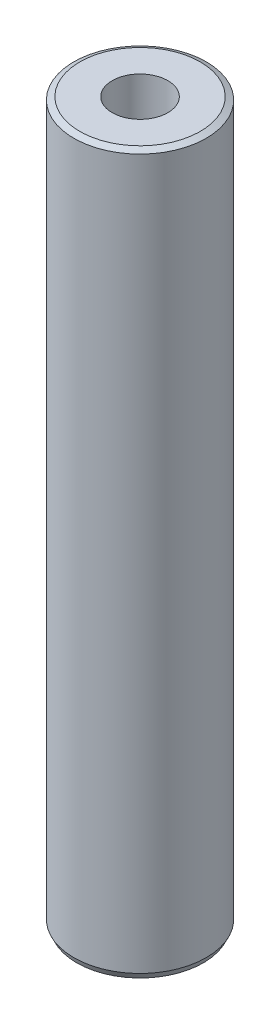
ISO-10303-21;
HEADER;
FILE_DESCRIPTION(('STEP AP214'),'2;1');
FILE_NAME('part.step','',(''),(''),'','','');
FILE_SCHEMA(('AUTOMOTIVE_DESIGN { 1 0 10303 214 1 1 1 1 }'));
ENDSEC;
DATA;
#1=APPLICATION_CONTEXT('core data for automotive mechanical design processes');
#2=APPLICATION_PROTOCOL_DEFINITION('international standard','automotive_design',2000,#1);
#3=PRODUCT_CONTEXT('',#1,'mechanical');
#4=PRODUCT('Part','Part','',(#3));
#5=PRODUCT_RELATED_PRODUCT_CATEGORY('part','',(#4));
#6=PRODUCT_DEFINITION_FORMATION('','',#4);
#7=PRODUCT_DEFINITION_CONTEXT('part definition',#1,'design');
#8=PRODUCT_DEFINITION('design','',#6,#7);
#9=PRODUCT_DEFINITION_SHAPE('','',#8);
#10=(LENGTH_UNIT() NAMED_UNIT(*) SI_UNIT(.MILLI.,.METRE.));
#11=(NAMED_UNIT(*) PLANE_ANGLE_UNIT() SI_UNIT($,.RADIAN.));
#12=(NAMED_UNIT(*) SI_UNIT($,.STERADIAN.) SOLID_ANGLE_UNIT());
#13=UNCERTAINTY_MEASURE_WITH_UNIT(LENGTH_MEASURE(1.E-05),#10,'distance_accuracy_value','');
#14=(GEOMETRIC_REPRESENTATION_CONTEXT(3) GLOBAL_UNCERTAINTY_ASSIGNED_CONTEXT((#13)) GLOBAL_UNIT_ASSIGNED_CONTEXT((#10,
#11,#12)) REPRESENTATION_CONTEXT('',''));
#15=CARTESIAN_POINT('',(0.,0.,0.));
#16=DIRECTION('',(0.,0.,1.));
#17=DIRECTION('',(1.,0.,0.));
#18=AXIS2_PLACEMENT_3D('',#15,#16,#17);
#19=CARTESIAN_POINT('',(0.,54.2338039481963,0.));
#20=DIRECTION('',(0.,-1.,0.));
#21=DIRECTION('',(0.,0.,-1.));
#22=AXIS2_PLACEMENT_3D('',#19,#20,#21);
#23=CYLINDRICAL_SURFACE('',#22,5.);
#24=CARTESIAN_POINT('',(0.,54.0129771005125,0.));
#25=DIRECTION('',(0.,1.,0.));
#26=DIRECTION('',(0.,0.,1.));
#27=AXIS2_PLACEMENT_3D('',#24,#25,#26);
#28=CIRCLE('',#27,5.);
#29=CARTESIAN_POINT('',(0.,54.0129771005125,-5.));
#30=VERTEX_POINT('',#29);
#31=EDGE_CURVE('E50',#30,#30,#28,.F.);
#32=CARTESIAN_POINT('',(0.,0.454026029524372,0.));
#33=DIRECTION('',(0.,1.,0.));
#34=DIRECTION('',(0.,0.,1.));
#35=AXIS2_PLACEMENT_3D('',#32,#33,#34);
#36=CIRCLE('',#35,5.);
#37=CARTESIAN_POINT('',(0.,0.454026029524365,-5.));
#38=VERTEX_POINT('',#37);
#39=EDGE_CURVE('E51',#38,#38,#36,.T.);
#40=CARTESIAN_POINT('',(0.,54.0129771005125,-5.));
#41=CARTESIAN_POINT('',(0.,53.4550713601897,-5.));
#42=CARTESIAN_POINT('',(0.,52.8971656198669,-5.));
#43=CARTESIAN_POINT('',(0.,51.7813541392213,-5.));
#44=CARTESIAN_POINT('',(0.,51.2234483988985,-5.));
#45=CARTESIAN_POINT('',(0.,50.107636918253,-5.));
#46=CARTESIAN_POINT('',(0.,49.5497311779302,-5.));
#47=CARTESIAN_POINT('',(0.,48.4339196972846,-5.));
#48=CARTESIAN_POINT('',(0.,47.8760139569618,-5.));
#49=CARTESIAN_POINT('',(0.,46.7602024763162,-5.));
#50=CARTESIAN_POINT('',(0.,46.2022967359934,-5.));
#51=CARTESIAN_POINT('',(0.,45.0864852553478,-5.));
#52=CARTESIAN_POINT('',(0.,44.528579515025,-5.));
#53=CARTESIAN_POINT('',(0.,43.4127680343794,-5.));
#54=CARTESIAN_POINT('',(0.,42.8548622940566,-5.));
#55=CARTESIAN_POINT('',(0.,41.7390508134111,-5.));
#56=CARTESIAN_POINT('',(0.,41.1811450730883,-5.));
#57=CARTESIAN_POINT('',(0.,40.0653335924427,-5.));
#58=CARTESIAN_POINT('',(0.,39.5074278521199,-5.));
#59=CARTESIAN_POINT('',(0.,38.3916163714743,-5.));
#60=CARTESIAN_POINT('',(0.,37.8337106311515,-5.));
#61=CARTESIAN_POINT('',(0.,36.7178991505059,-5.));
#62=CARTESIAN_POINT('',(0.,36.1599934101831,-5.));
#63=CARTESIAN_POINT('',(0.,35.0441819295375,-5.));
#64=CARTESIAN_POINT('',(0.,34.4862761892147,-5.));
#65=CARTESIAN_POINT('',(0.,33.3704647085692,-5.));
#66=CARTESIAN_POINT('',(0.,32.8125589682464,-5.));
#67=CARTESIAN_POINT('',(0.,31.6967474876008,-5.));
#68=CARTESIAN_POINT('',(0.,31.138841747278,-5.));
#69=CARTESIAN_POINT('',(0.,30.0230302666324,-5.));
#70=CARTESIAN_POINT('',(0.,29.4651245263096,-5.));
#71=CARTESIAN_POINT('',(0.,28.349313045664,-5.));
#72=CARTESIAN_POINT('',(0.,27.7914073053412,-5.));
#73=CARTESIAN_POINT('',(0.,26.6755958246956,-5.));
#74=CARTESIAN_POINT('',(0.,26.1176900843728,-5.));
#75=CARTESIAN_POINT('',(0.,25.0018786037273,-5.));
#76=CARTESIAN_POINT('',(0.,24.4439728634045,-5.));
#77=CARTESIAN_POINT('',(0.,23.3281613827589,-5.));
#78=CARTESIAN_POINT('',(0.,22.7702556424361,-5.));
#79=CARTESIAN_POINT('',(0.,21.6544441617905,-5.));
#80=CARTESIAN_POINT('',(0.,21.0965384214677,-5.));
#81=CARTESIAN_POINT('',(0.,19.9807269408221,-5.));
#82=CARTESIAN_POINT('',(0.,19.4228212004993,-5.));
#83=CARTESIAN_POINT('',(0.,18.3070097198537,-5.));
#84=CARTESIAN_POINT('',(0.,17.7491039795309,-5.));
#85=CARTESIAN_POINT('',(0.,16.6332924988854,-5.));
#86=CARTESIAN_POINT('',(0.,16.0753867585626,-5.));
#87=CARTESIAN_POINT('',(0.,14.959575277917,-5.));
#88=CARTESIAN_POINT('',(0.,14.4016695375942,-5.));
#89=CARTESIAN_POINT('',(0.,13.2858580569486,-5.));
#90=CARTESIAN_POINT('',(0.,12.7279523166258,-5.));
#91=CARTESIAN_POINT('',(0.,11.6121408359802,-5.));
#92=CARTESIAN_POINT('',(0.,11.0542350956574,-5.));
#93=CARTESIAN_POINT('',(0.,9.93842361501184,-5.));
#94=CARTESIAN_POINT('',(0.,9.38051787468905,-5.));
#95=CARTESIAN_POINT('',(0.,8.26470639404347,-5.));
#96=CARTESIAN_POINT('',(0.,7.70680065372067,-5.));
#97=CARTESIAN_POINT('',(0.,6.59098917307508,-5.));
#98=CARTESIAN_POINT('',(0.,6.03308343275229,-5.));
#99=CARTESIAN_POINT('',(0.,4.91727195210671,-5.));
#100=CARTESIAN_POINT('',(0.,4.35936621178392,-5.));
#101=CARTESIAN_POINT('',(0.,3.24355473113833,-5.));
#102=CARTESIAN_POINT('',(0.,2.68564899081553,-5.));
#103=CARTESIAN_POINT('',(0.,1.56983751016995,-5.));
#104=CARTESIAN_POINT('',(0.,1.01193176984716,-5.));
#105=CARTESIAN_POINT('',(0.,0.454026029524365,-5.));
#106=B_SPLINE_CURVE_WITH_KNOTS('',3,(#40,#41,#42,#43,#44,#45,#46,#47,#48,#49,#50,#51,#52,#53,
#54,#55,#56,#57,#58,#59,#60,#61,#62,#63,#64,#65,#66,#67,#68,#69,#70,#71,#72,#73,#74,#75,#76,#77,
#78,#79,#80,#81,#82,#83,#84,#85,#86,#87,#88,#89,#90,#91,#92,#93,#94,#95,#96,#97,#98,#99,#100,
#101,#102,#103,#104,#105),.UNSPECIFIED.,.F.,.F.,(4,2,2,2,2,2,2,2,2,2,2,2,2,2,2,2,2,2,2,2,2,2,2,
2,2,2,2,2,2,2,2,2,4),(0.,1.67371722096838,3.34743444193676,5.02115166290514,6.69486888387352,
8.3685861048419,10.0423033258103,11.7160205467787,13.389737767747,15.0634549887154,
16.7371722096838,18.4108894306522,20.0846066516206,21.7583238725889,23.4320410935573,
25.1057583145257,26.7794755354941,28.4531927564625,30.1269099774308,31.8006271983992,
33.4743444193676,35.148061640336,36.8217788613043,38.4954960822727,40.1692133032411,
41.8429305242095,43.5166477451779,45.1903649661462,46.8640821871146,48.537799408083,
50.2115166290514,51.8852338500198,53.5589510709881),.UNSPECIFIED.);
#107=EDGE_CURVE('BSEAM39',#30,#38,#106,.T.);
#108=ORIENTED_EDGE('',*,*,#31,.T.);
#109=ORIENTED_EDGE('',*,*,#39,.T.);
#110=ORIENTED_EDGE('',*,*,#107,.T.);
#111=ORIENTED_EDGE('',*,*,#107,.F.);
#112=EDGE_LOOP('',(#108,#110,#109,#111));
#113=FACE_BOUND('',#112,.T.);
#114=ADVANCED_FACE('F39',(#113),#23,.T.);
#115=CARTESIAN_POINT('',(0.,54.2338039481963,0.));
#116=DIRECTION('',(0.,1.,0.));
#117=DIRECTION('',(0.,0.,1.));
#118=AXIS2_PLACEMENT_3D('',#115,#116,#117);
#119=PLANE('',#118);
#120=CARTESIAN_POINT('',(0.,54.2338039481963,0.));
#121=DIRECTION('',(0.,1.,0.));
#122=DIRECTION('',(0.,0.,1.));
#123=AXIS2_PLACEMENT_3D('',#120,#121,#122);
#124=CIRCLE('',#123,4.54597397047565);
#125=CARTESIAN_POINT('',(0.,54.2338039481962,-4.54597397047565));
#126=VERTEX_POINT('',#125);
#127=EDGE_CURVE('E54',#126,#126,#124,.T.);
#128=ORIENTED_EDGE('',*,*,#127,.T.);
#129=EDGE_LOOP('',(#128));
#130=FACE_BOUND('',#129,.T.);
#131=CARTESIAN_POINT('',(0.,54.2338039481963,0.));
#132=DIRECTION('',(0.,1.,0.));
#133=DIRECTION('',(0.,0.,1.));
#134=AXIS2_PLACEMENT_3D('',#131,#132,#133);
#135=CIRCLE('',#134,2.09885648231418);
#136=CARTESIAN_POINT('',(0.,54.2338039481963,2.09885648231418));
#137=VERTEX_POINT('',#136);
#138=EDGE_CURVE('E58',#137,#137,#135,.T.);
#139=ORIENTED_EDGE('',*,*,#138,.F.);
#140=EDGE_LOOP('',(#139));
#141=FACE_BOUND('',#140,.T.);
#142=ADVANCED_FACE('F69',(#130,#141),#119,.T.);
#143=CARTESIAN_POINT('',(0.,0.,0.));
#144=DIRECTION('',(0.,1.,0.));
#145=DIRECTION('',(0.,0.,1.));
#146=AXIS2_PLACEMENT_3D('',#143,#144,#145);
#147=PLANE('',#146);
#148=CARTESIAN_POINT('',(0.,0.,0.));
#149=DIRECTION('',(0.,1.,0.));
#150=DIRECTION('',(0.,0.,1.));
#151=AXIS2_PLACEMENT_3D('',#148,#149,#150);
#152=CIRCLE('',#151,4.77917315231624);
#153=CARTESIAN_POINT('',(0.,0.,4.77917315231624));
#154=VERTEX_POINT('',#153);
#155=EDGE_CURVE('E10',#154,#154,#152,.F.);
#156=ORIENTED_EDGE('',*,*,#155,.T.);
#157=EDGE_LOOP('',(#156));
#158=FACE_BOUND('',#157,.T.);
#159=CARTESIAN_POINT('',(0.,0.,0.));
#160=DIRECTION('',(0.,1.,0.));
#161=DIRECTION('',(0.,0.,1.));
#162=AXIS2_PLACEMENT_3D('',#159,#160,#161);
#163=CIRCLE('',#162,2.09885648231418);
#164=CARTESIAN_POINT('',(0.,0.,2.09885648231418));
#165=VERTEX_POINT('',#164);
#166=EDGE_CURVE('E63',#165,#165,#163,.T.);
#167=ORIENTED_EDGE('',*,*,#166,.T.);
#168=EDGE_LOOP('',(#167));
#169=FACE_BOUND('',#168,.T.);
#170=ADVANCED_FACE('F75',(#158,#169),#147,.F.);
#171=CARTESIAN_POINT('',(0.,54.2338039481963,0.));
#172=DIRECTION('',(0.,-1.,0.));
#173=DIRECTION('',(0.,0.,-1.));
#174=AXIS2_PLACEMENT_3D('',#171,#172,#173);
#175=CYLINDRICAL_SURFACE('',#174,2.09885648231418);
#176=ORIENTED_EDGE('',*,*,#138,.T.);
#177=EDGE_LOOP('',(#176));
#178=FACE_BOUND('',#177,.T.);
#179=ORIENTED_EDGE('',*,*,#166,.F.);
#180=EDGE_LOOP('',(#179));
#181=FACE_BOUND('',#180,.T.);
#182=ADVANCED_FACE('F70',(#178,#181),#175,.F.);
#183=CARTESIAN_POINT('',(0.,54.2338039481963,0.));
#184=DIRECTION('',(0.,-1.,0.));
#185=DIRECTION('',(0.,0.,-1.));
#186=AXIS2_PLACEMENT_3D('',#183,#184,#185);
#187=CONICAL_SURFACE('',#186,4.54597397047565,1.11810812073644);
#188=CARTESIAN_POINT('',(0.,54.0129771005125,-5.00000000000001));
#189=CARTESIAN_POINT('',(0.,54.0152773801759,-4.99527056219246));
#190=CARTESIAN_POINT('',(0.,54.0175776598392,-4.99054112438492));
#191=CARTESIAN_POINT('',(0.,54.022178219166,-4.98108224876983));
#192=CARTESIAN_POINT('',(0.,54.0244784988294,-4.97635281096228));
#193=CARTESIAN_POINT('',(0.,54.0290790581561,-4.96689393534719));
#194=CARTESIAN_POINT('',(0.,54.0313793378195,-4.96216449753964));
#195=CARTESIAN_POINT('',(0.,54.0359798971462,-4.95270562192455));
#196=CARTESIAN_POINT('',(0.,54.0382801768096,-4.94797618411701));
#197=CARTESIAN_POINT('',(0.,54.0428807361363,-4.93851730850192));
#198=CARTESIAN_POINT('',(0.,54.0451810157997,-4.93378787069437));
#199=CARTESIAN_POINT('',(0.,54.0497815751265,-4.92432899507928));
#200=CARTESIAN_POINT('',(0.,54.0520818547898,-4.91959955727174));
#201=CARTESIAN_POINT('',(0.,54.0566824141166,-4.91014068165665));
#202=CARTESIAN_POINT('',(0.,54.0589826937799,-4.9054112438491));
#203=CARTESIAN_POINT('',(0.,54.0635832531067,-4.89595236823401));
#204=CARTESIAN_POINT('',(0.,54.0658835327701,-4.89122293042646));
#205=CARTESIAN_POINT('',(0.,54.0704840920968,-4.88176405481137));
#206=CARTESIAN_POINT('',(0.,54.0727843717602,-4.87703461700383));
#207=CARTESIAN_POINT('',(0.,54.0773849310869,-4.86757574138874));
#208=CARTESIAN_POINT('',(0.,54.0796852107503,-4.86284630358119));
#209=CARTESIAN_POINT('',(0.,54.084285770077,-4.8533874279661));
#210=CARTESIAN_POINT('',(0.,54.0865860497404,-4.84865799015856));
#211=CARTESIAN_POINT('',(0.,54.0911866090672,-4.83919911454347));
#212=CARTESIAN_POINT('',(0.,54.0934868887305,-4.83446967673592));
#213=CARTESIAN_POINT('',(0.,54.0980874480573,-4.82501080112083));
#214=CARTESIAN_POINT('',(0.,54.1003877277207,-4.82028136331328));
#215=CARTESIAN_POINT('',(0.,54.1049882870474,-4.81082248769819));
#216=CARTESIAN_POINT('',(0.,54.1072885667108,-4.80609304989065));
#217=CARTESIAN_POINT('',(0.,54.1118891260375,-4.79663417427556));
#218=CARTESIAN_POINT('',(0.,54.1141894057009,-4.79190473646801));
#219=CARTESIAN_POINT('',(0.,54.1187899650276,-4.78244586085292));
#220=CARTESIAN_POINT('',(0.,54.121090244691,-4.77771642304538));
#221=CARTESIAN_POINT('',(0.,54.1256908040177,-4.76825754743028));
#222=CARTESIAN_POINT('',(0.,54.1279910836811,-4.76352810962274));
#223=CARTESIAN_POINT('',(0.,54.1325916430079,-4.75406923400765));
#224=CARTESIAN_POINT('',(0.,54.1348919226712,-4.7493397962001));
#225=CARTESIAN_POINT('',(0.,54.139492481998,-4.73988092058501));
#226=CARTESIAN_POINT('',(0.,54.1417927616613,-4.73515148277747));
#227=CARTESIAN_POINT('',(0.,54.1463933209881,-4.72569260716238));
#228=CARTESIAN_POINT('',(0.,54.1486936006515,-4.72096316935483));
#229=CARTESIAN_POINT('',(0.,54.1532941599782,-4.71150429373974));
#230=CARTESIAN_POINT('',(0.,54.1555944396416,-4.7067748559322));
#231=CARTESIAN_POINT('',(0.,54.1601949989683,-4.6973159803171));
#232=CARTESIAN_POINT('',(0.,54.1624952786317,-4.69258654250956));
#233=CARTESIAN_POINT('',(0.,54.1670958379584,-4.68312766689447));
#234=CARTESIAN_POINT('',(0.,54.1693961176218,-4.67839822908692));
#235=CARTESIAN_POINT('',(0.,54.1739966769486,-4.66893935347183));
#236=CARTESIAN_POINT('',(0.,54.1762969566119,-4.66420991566429));
#237=CARTESIAN_POINT('',(0.,54.1808975159387,-4.6547510400492));
#238=CARTESIAN_POINT('',(0.,54.1831977956021,-4.65002160224165));
#239=CARTESIAN_POINT('',(0.,54.1877983549288,-4.64056272662656));
#240=CARTESIAN_POINT('',(0.,54.1900986345922,-4.63583328881902));
#241=CARTESIAN_POINT('',(0.,54.1946991939189,-4.62637441320392));
#242=CARTESIAN_POINT('',(0.,54.1969994735823,-4.62164497539638));
#243=CARTESIAN_POINT('',(0.,54.201600032909,-4.61218609978129));
#244=CARTESIAN_POINT('',(0.,54.2039003125724,-4.60745666197374));
#245=CARTESIAN_POINT('',(0.,54.2085008718992,-4.59799778635865));
#246=CARTESIAN_POINT('',(0.,54.2108011515625,-4.59326834855111));
#247=CARTESIAN_POINT('',(0.,54.2154017108893,-4.58380947293602));
#248=CARTESIAN_POINT('',(0.,54.2177019905526,-4.57908003512847));
#249=CARTESIAN_POINT('',(0.,54.2223025498794,-4.56962115951338));
#250=CARTESIAN_POINT('',(0.,54.2246028295428,-4.56489172170583));
#251=CARTESIAN_POINT('',(0.,54.2292033888695,-4.55543284609074));
#252=CARTESIAN_POINT('',(0.,54.2315036685329,-4.5507034082832));
#253=CARTESIAN_POINT('',(0.,54.2338039481963,-4.54597397047565));
#254=B_SPLINE_CURVE_WITH_KNOTS('',3,(#188,#189,#190,#191,#192,#193,#194,#195,#196,#197,#198,
#199,#200,#201,#202,#203,#204,#205,#206,#207,#208,#209,#210,#211,#212,#213,#214,#215,#216,#217,
#218,#219,#220,#221,#222,#223,#224,#225,#226,#227,#228,#229,#230,#231,#232,#233,#234,#235,#236,
#237,#238,#239,#240,#241,#242,#243,#244,#245,#246,#247,#248,#249,#250,#251,#252,#253),
.UNSPECIFIED.,.F.,.F.,(4,2,2,2,2,2,2,2,2,2,2,2,2,2,2,2,2,2,2,2,2,2,2,2,2,2,2,2,2,2,2,2,4),(0.,
0.0157775098335092,0.0315550196670184,0.0473325295005276,0.0631100393340368,0.0788875491675461,
0.0946650590010553,0.110442568834564,0.126220078668074,0.141997588501583,0.157775098335093,
0.173552608168602,0.189330118002111,0.205107627835621,0.22088513766913,0.236662647502639,
0.252440157336145,0.268217667169654,0.283995177003163,0.299772686836673,0.315550196670183,
0.331327706503692,0.347105216337201,0.36288272617071,0.378660236004219,0.394437745837729,
0.410215255671238,0.425992765504747,0.441770275338256,0.457547785171765,0.473325295005275,
0.489102804838785,0.504880314672294),.UNSPECIFIED.);
#255=EDGE_CURVE('BSEAM81',#30,#126,#254,.T.);
#256=ORIENTED_EDGE('',*,*,#31,.F.);
#257=ORIENTED_EDGE('',*,*,#127,.F.);
#258=ORIENTED_EDGE('',*,*,#255,.T.);
#259=ORIENTED_EDGE('',*,*,#255,.F.);
#260=EDGE_LOOP('',(#256,#258,#257,#259));
#261=FACE_BOUND('',#260,.T.);
#262=ADVANCED_FACE('F81',(#261),#187,.T.);
#263=CARTESIAN_POINT('',(0.,0.454026029524372,0.));
#264=DIRECTION('',(0.,1.,0.));
#265=DIRECTION('',(0.,0.,1.));
#266=AXIS2_PLACEMENT_3D('',#263,#264,#265);
#267=CONICAL_SURFACE('',#266,5.,0.45268820605845);
#268=ORIENTED_EDGE('',*,*,#155,.F.);
#269=EDGE_LOOP('',(#268));
#270=FACE_BOUND('',#269,.T.);
#271=ORIENTED_EDGE('',*,*,#39,.F.);
#272=EDGE_LOOP('',(#271));
#273=FACE_BOUND('',#272,.T.);
#274=ADVANCED_FACE('F45',(#270,#273),#267,.T.);
#275=CLOSED_SHELL('',(#114,#142,#170,#182,#262,#274));
#276=MANIFOLD_SOLID_BREP('B2',#275);
#277=ADVANCED_BREP_SHAPE_REPRESENTATION('',(#18,#276),#14);
#278=SHAPE_DEFINITION_REPRESENTATION(#9,#277);
ENDSEC;
END-ISO-10303-21;
